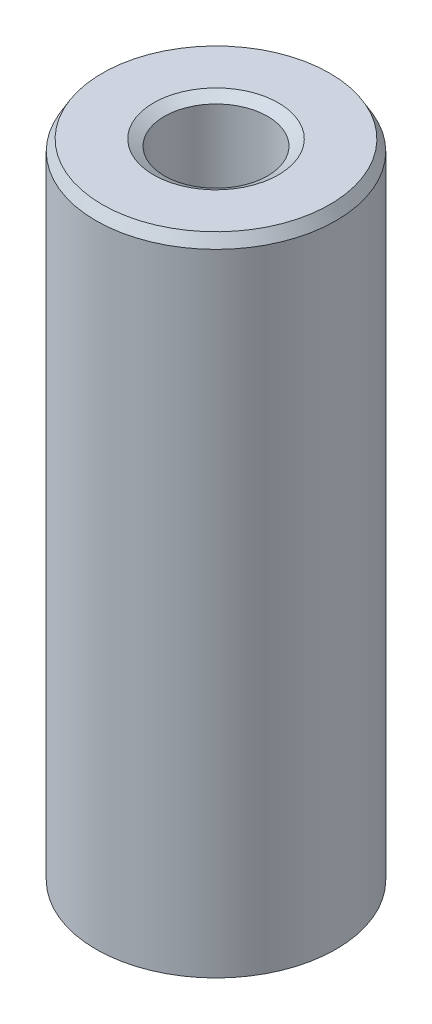
ISO-10303-21;
HEADER;
FILE_DESCRIPTION(('STEP AP214'),'2;1');
FILE_NAME('part.step','',(''),(''),'','','');
FILE_SCHEMA(('AUTOMOTIVE_DESIGN { 1 0 10303 214 1 1 1 1 }'));
ENDSEC;
DATA;
#1=APPLICATION_CONTEXT('core data for automotive mechanical design processes');
#2=APPLICATION_PROTOCOL_DEFINITION('international standard','automotive_design',2000,#1);
#3=PRODUCT_CONTEXT('',#1,'mechanical');
#4=PRODUCT('Part','Part','',(#3));
#5=PRODUCT_RELATED_PRODUCT_CATEGORY('part','',(#4));
#6=PRODUCT_DEFINITION_FORMATION('','',#4);
#7=PRODUCT_DEFINITION_CONTEXT('part definition',#1,'design');
#8=PRODUCT_DEFINITION('design','',#6,#7);
#9=PRODUCT_DEFINITION_SHAPE('','',#8);
#10=(LENGTH_UNIT() NAMED_UNIT(*) SI_UNIT(.MILLI.,.METRE.));
#11=(NAMED_UNIT(*) PLANE_ANGLE_UNIT() SI_UNIT($,.RADIAN.));
#12=(NAMED_UNIT(*) SI_UNIT($,.STERADIAN.) SOLID_ANGLE_UNIT());
#13=UNCERTAINTY_MEASURE_WITH_UNIT(LENGTH_MEASURE(1.E-05),#10,'distance_accuracy_value','');
#14=(GEOMETRIC_REPRESENTATION_CONTEXT(3) GLOBAL_UNCERTAINTY_ASSIGNED_CONTEXT((#13)) GLOBAL_UNIT_ASSIGNED_CONTEXT((#10,
#11,#12)) REPRESENTATION_CONTEXT('',''));
#15=CARTESIAN_POINT('',(0.,0.,0.));
#16=DIRECTION('',(0.,0.,1.));
#17=DIRECTION('',(1.,0.,0.));
#18=AXIS2_PLACEMENT_3D('',#15,#16,#17);
#19=CARTESIAN_POINT('',(0.,188.946257243484,0.));
#20=DIRECTION('',(0.,-1.,0.));
#21=DIRECTION('',(0.,0.,-1.));
#22=AXIS2_PLACEMENT_3D('',#19,#20,#21);
#23=CYLINDRICAL_SURFACE('',#22,35.);
#24=CARTESIAN_POINT('',(0.,1.82356444192366,0.));
#25=DIRECTION('',(0.,1.,0.));
#26=DIRECTION('',(0.,0.,1.));
#27=AXIS2_PLACEMENT_3D('',#24,#25,#26);
#28=CIRCLE('',#27,35.);
#29=CARTESIAN_POINT('',(0.,1.82356444192366,35.));
#30=VERTEX_POINT('',#29);
#31=EDGE_CURVE('E10',#30,#30,#28,.T.);
#32=ORIENTED_EDGE('',*,*,#31,.T.);
#33=EDGE_LOOP('',(#32));
#34=FACE_BOUND('',#33,.T.);
#35=CARTESIAN_POINT('',(0.,185.787750979196,0.));
#36=DIRECTION('',(0.,1.,0.));
#37=DIRECTION('',(0.,0.,1.));
#38=AXIS2_PLACEMENT_3D('',#35,#36,#37);
#39=CIRCLE('',#38,35.);
#40=CARTESIAN_POINT('',(0.,185.787750979196,35.));
#41=VERTEX_POINT('',#40);
#42=EDGE_CURVE('E50',#41,#41,#39,.F.);
#43=ORIENTED_EDGE('',*,*,#42,.T.);
#44=EDGE_LOOP('',(#43));
#45=FACE_BOUND('',#44,.T.);
#46=ADVANCED_FACE('F39',(#34,#45),#23,.T.);
#47=CARTESIAN_POINT('',(0.,188.946257243484,0.));
#48=DIRECTION('',(0.,1.,0.));
#49=DIRECTION('',(0.,0.,1.));
#50=AXIS2_PLACEMENT_3D('',#47,#48,#49);
#51=PLANE('',#50);
#52=CARTESIAN_POINT('',(0.,188.946257243484,0.));
#53=DIRECTION('',(0.,1.,0.));
#54=DIRECTION('',(0.,0.,1.));
#55=AXIS2_PLACEMENT_3D('',#52,#53,#54);
#56=CIRCLE('',#55,18.2065849074306);
#57=CARTESIAN_POINT('',(0.,188.946257243484,18.2065849074306));
#58=VERTEX_POINT('',#57);
#59=EDGE_CURVE('E58',#58,#58,#56,.F.);
#60=ORIENTED_EDGE('',*,*,#59,.T.);
#61=EDGE_LOOP('',(#60));
#62=FACE_BOUND('',#61,.T.);
#63=CARTESIAN_POINT('',(0.,188.946257243484,0.));
#64=DIRECTION('',(0.,1.,0.));
#65=DIRECTION('',(0.,0.,1.));
#66=AXIS2_PLACEMENT_3D('',#63,#64,#65);
#67=CIRCLE('',#66,33.1764355580764);
#68=CARTESIAN_POINT('',(0.,188.946257243484,33.1764355580764));
#69=VERTEX_POINT('',#68);
#70=EDGE_CURVE('E61',#69,#69,#67,.T.);
#71=ORIENTED_EDGE('',*,*,#70,.T.);
#72=EDGE_LOOP('',(#71));
#73=FACE_BOUND('',#72,.T.);
#74=ADVANCED_FACE('F88',(#62,#73),#51,.T.);
#75=CARTESIAN_POINT('',(0.,0.,0.));
#76=DIRECTION('',(0.,1.,0.));
#77=DIRECTION('',(0.,0.,1.));
#78=AXIS2_PLACEMENT_3D('',#75,#76,#77);
#79=PLANE('',#78);
#80=CARTESIAN_POINT('',(0.,0.,0.));
#81=DIRECTION('',(0.,1.,0.));
#82=DIRECTION('',(0.,0.,1.));
#83=AXIS2_PLACEMENT_3D('',#80,#81,#82);
#84=CIRCLE('',#83,16.8716430850665);
#85=CARTESIAN_POINT('',(0.,0.,-16.8716430850665));
#86=VERTEX_POINT('',#85);
#87=EDGE_CURVE('E51',#86,#86,#84,.T.);
#88=ORIENTED_EDGE('',*,*,#87,.T.);
#89=EDGE_LOOP('',(#88));
#90=FACE_BOUND('',#89,.T.);
#91=CARTESIAN_POINT('',(0.,0.,0.));
#92=DIRECTION('',(0.,1.,0.));
#93=DIRECTION('',(0.,0.,1.));
#94=AXIS2_PLACEMENT_3D('',#91,#92,#93);
#95=CIRCLE('',#94,31.8414937357122);
#96=CARTESIAN_POINT('',(0.,0.,31.8414937357122));
#97=VERTEX_POINT('',#96);
#98=EDGE_CURVE('E54',#97,#97,#95,.F.);
#99=ORIENTED_EDGE('',*,*,#98,.T.);
#100=EDGE_LOOP('',(#99));
#101=FACE_BOUND('',#100,.T.);
#102=ADVANCED_FACE('F83',(#90,#101),#79,.F.);
#103=CARTESIAN_POINT('',(0.,188.946257243484,0.));
#104=DIRECTION('',(0.,-1.,0.));
#105=DIRECTION('',(0.,0.,-1.));
#106=AXIS2_PLACEMENT_3D('',#103,#104,#105);
#107=CYLINDRICAL_SURFACE('',#106,15.0480786431428);
#108=CARTESIAN_POINT('',(0.,187.12269280156,0.));
#109=DIRECTION('',(0.,1.,0.));
#110=DIRECTION('',(0.,0.,1.));
#111=AXIS2_PLACEMENT_3D('',#108,#109,#110);
#112=CIRCLE('',#111,15.0480786431428);
#113=CARTESIAN_POINT('',(0.,187.12269280156,15.0480786431428));
#114=VERTEX_POINT('',#113);
#115=EDGE_CURVE('E67',#114,#114,#112,.T.);
#116=ORIENTED_EDGE('',*,*,#115,.T.);
#117=EDGE_LOOP('',(#116));
#118=FACE_BOUND('',#117,.T.);
#119=CARTESIAN_POINT('',(0.,3.15850626428779,0.));
#120=DIRECTION('',(0.,1.,0.));
#121=DIRECTION('',(0.,0.,1.));
#122=AXIS2_PLACEMENT_3D('',#119,#120,#121);
#123=CIRCLE('',#122,15.0480786431428);
#124=CARTESIAN_POINT('',(0.,3.15850626428779,-15.0480786431428));
#125=VERTEX_POINT('',#124);
#126=EDGE_CURVE('E69',#125,#125,#123,.F.);
#127=ORIENTED_EDGE('',*,*,#126,.T.);
#128=EDGE_LOOP('',(#127));
#129=FACE_BOUND('',#128,.T.);
#130=ADVANCED_FACE('F71',(#118,#129),#107,.F.);
#131=CARTESIAN_POINT('',(0.,187.12269280156,0.));
#132=DIRECTION('',(0.,1.,0.));
#133=DIRECTION('',(0.,0.,1.));
#134=AXIS2_PLACEMENT_3D('',#131,#132,#133);
#135=CONICAL_SURFACE('',#134,15.0480786431428,1.0471975511966);
#136=ORIENTED_EDGE('',*,*,#59,.F.);
#137=EDGE_LOOP('',(#136));
#138=FACE_BOUND('',#137,.T.);
#139=ORIENTED_EDGE('',*,*,#115,.F.);
#140=EDGE_LOOP('',(#139));
#141=FACE_BOUND('',#140,.T.);
#142=ADVANCED_FACE('F77',(#138,#141),#135,.F.);
#143=CARTESIAN_POINT('',(0.,0.,0.));
#144=DIRECTION('',(0.,-1.,0.));
#145=DIRECTION('',(0.,0.,-1.));
#146=AXIS2_PLACEMENT_3D('',#143,#144,#145);
#147=CONICAL_SURFACE('',#146,16.8716430850665,0.523598775598294);
#148=CARTESIAN_POINT('',(0.,3.15850626428779,-15.0480786431428));
#149=CARTESIAN_POINT('',(0.,3.12560515736813,-15.0670741060796));
#150=CARTESIAN_POINT('',(0.,3.09270405044846,-15.0860695690163));
#151=CARTESIAN_POINT('',(0.,3.02690183660913,-15.1240604948897));
#152=CARTESIAN_POINT('',(0.,2.99400072968947,-15.1430559578264));
#153=CARTESIAN_POINT('',(0.,2.92819851585014,-15.1810468836998));
#154=CARTESIAN_POINT('',(0.,2.89529740893047,-15.2000423466365));
#155=CARTESIAN_POINT('',(0.,2.82949519509115,-15.2380332725099));
#156=CARTESIAN_POINT('',(0.,2.79659408817148,-15.2570287354466));
#157=CARTESIAN_POINT('',(0.,2.73079187433215,-15.29501966132));
#158=CARTESIAN_POINT('',(0.,2.69789076741249,-15.3140151242567));
#159=CARTESIAN_POINT('',(0.,2.63208855357316,-15.3520060501301));
#160=CARTESIAN_POINT('',(0.,2.59918744665349,-15.3710015130668));
#161=CARTESIAN_POINT('',(0.,2.53338523281417,-15.4089924389402));
#162=CARTESIAN_POINT('',(0.,2.5004841258945,-15.4279879018769));
#163=CARTESIAN_POINT('',(0.,2.43468191205517,-15.4659788277504));
#164=CARTESIAN_POINT('',(0.,2.40178080513551,-15.4849742906871));
#165=CARTESIAN_POINT('',(0.,2.33597859129618,-15.5229652165605));
#166=CARTESIAN_POINT('',(0.,2.30307748437651,-15.5419606794972));
#167=CARTESIAN_POINT('',(0.,2.23727527053719,-15.5799516053706));
#168=CARTESIAN_POINT('',(0.,2.20437416361752,-15.5989470683073));
#169=CARTESIAN_POINT('',(0.,2.13857194977819,-15.6369379941807));
#170=CARTESIAN_POINT('',(0.,2.10567084285853,-15.6559334571174));
#171=CARTESIAN_POINT('',(0.,2.0398686290192,-15.6939243829908));
#172=CARTESIAN_POINT('',(0.,2.00696752209953,-15.7129198459275));
#173=CARTESIAN_POINT('',(0.,1.9411653082602,-15.7509107718009));
#174=CARTESIAN_POINT('',(0.,1.90826420134054,-15.7699062347376));
#175=CARTESIAN_POINT('',(0.,1.84246198750121,-15.807897160611));
#176=CARTESIAN_POINT('',(0.,1.80956088058155,-15.8268926235477));
#177=CARTESIAN_POINT('',(0.,1.74375866674222,-15.8648835494212));
#178=CARTESIAN_POINT('',(0.,1.71085755982255,-15.8838790123579));
#179=CARTESIAN_POINT('',(0.,1.64505534598322,-15.9218699382313));
#180=CARTESIAN_POINT('',(0.,1.61215423906356,-15.940865401168));
#181=CARTESIAN_POINT('',(0.,1.54635202522423,-15.9788563270414));
#182=CARTESIAN_POINT('',(0.,1.51345091830457,-15.9978517899781));
#183=CARTESIAN_POINT('',(0.,1.44764870446524,-16.0358427158515));
#184=CARTESIAN_POINT('',(0.,1.41474759754557,-16.0548381787882));
#185=CARTESIAN_POINT('',(0.,1.34894538370624,-16.0928291046616));
#186=CARTESIAN_POINT('',(0.,1.31604427678658,-16.1118245675983));
#187=CARTESIAN_POINT('',(0.,1.25024206294725,-16.1498154934717));
#188=CARTESIAN_POINT('',(0.,1.21734095602759,-16.1688109564084));
#189=CARTESIAN_POINT('',(0.,1.15153874218826,-16.2068018822818));
#190=CARTESIAN_POINT('',(0.,1.11863763526859,-16.2257973452185));
#191=CARTESIAN_POINT('',(0.,1.05283542142926,-16.2637882710919));
#192=CARTESIAN_POINT('',(0.,1.0199343145096,-16.2827837340287));
#193=CARTESIAN_POINT('',(0.,0.95413210067027,-16.3207746599021));
#194=CARTESIAN_POINT('',(0.,0.921230993750606,-16.3397701228388));
#195=CARTESIAN_POINT('',(0.,0.855428779911277,-16.3777610487122));
#196=CARTESIAN_POINT('',(0.,0.822527672991612,-16.3967565116489));
#197=CARTESIAN_POINT('',(0.,0.756725459152283,-16.4347474375223));
#198=CARTESIAN_POINT('',(0.,0.723824352232619,-16.453742900459));
#199=CARTESIAN_POINT('',(0.,0.65802213839329,-16.4917338263324));
#200=CARTESIAN_POINT('',(0.,0.625121031473626,-16.5107292892691));
#201=CARTESIAN_POINT('',(0.,0.559318817634296,-16.5487202151425));
#202=CARTESIAN_POINT('',(0.,0.526417710714632,-16.5677156780792));
#203=CARTESIAN_POINT('',(0.,0.460615496875303,-16.6057066039526));
#204=CARTESIAN_POINT('',(0.,0.427714389955638,-16.6247020668893));
#205=CARTESIAN_POINT('',(0.,0.361912176116309,-16.6626929927627));
#206=CARTESIAN_POINT('',(0.,0.329011069196645,-16.6816884556995));
#207=CARTESIAN_POINT('',(0.,0.263208855357316,-16.7196793815729));
#208=CARTESIAN_POINT('',(0.,0.230307748437651,-16.7386748445096));
#209=CARTESIAN_POINT('',(0.,0.164505534598322,-16.776665770383));
#210=CARTESIAN_POINT('',(0.,0.131604427678658,-16.7956612333197));
#211=CARTESIAN_POINT('',(0.,0.065802213839329,-16.8336521591931));
#212=CARTESIAN_POINT('',(0.,0.0329011069196645,-16.8526476221298));
#213=CARTESIAN_POINT('',(0.,0.,-16.8716430850665));
#214=B_SPLINE_CURVE_WITH_KNOTS('',3,(#148,#149,#150,#151,#152,#153,#154,#155,#156,#157,#158,
#159,#160,#161,#162,#163,#164,#165,#166,#167,#168,#169,#170,#171,#172,#173,#174,#175,#176,#177,
#178,#179,#180,#181,#182,#183,#184,#185,#186,#187,#188,#189,#190,#191,#192,#193,#194,#195,#196,
#197,#198,#199,#200,#201,#202,#203,#204,#205,#206,#207,#208,#209,#210,#211,#212,#213),
.UNSPECIFIED.,.F.,.F.,(4,2,2,2,2,2,2,2,2,2,2,2,2,2,2,2,2,2,2,2,2,2,2,2,2,2,2,2,2,2,2,2,4),(0.,
0.11397277762023,0.227945555240459,0.341918332860688,0.455891110480917,0.569863888101147,
0.683836665721376,0.797809443341606,0.911782220961835,1.02575499858206,1.13972777620229,
1.25370055382252,1.36767333144275,1.48164610906298,1.59561888668321,1.70959166430344,
1.82356444192367,1.9375372195439,2.05150999716413,2.16548277478436,2.27945555240459,
2.39342833002482,2.50740110764505,2.62137388526527,2.7353466628855,2.84931944050573,
2.96329221812596,3.07726499574619,3.19123777336642,3.30521055098665,3.41918332860688,
3.53315610622711,3.64712888384734),.UNSPECIFIED.);
#215=EDGE_CURVE('BSEAM73',#125,#86,#214,.T.);
#216=ORIENTED_EDGE('',*,*,#126,.F.);
#217=ORIENTED_EDGE('',*,*,#87,.F.);
#218=ORIENTED_EDGE('',*,*,#215,.T.);
#219=ORIENTED_EDGE('',*,*,#215,.F.);
#220=EDGE_LOOP('',(#216,#218,#217,#219));
#221=FACE_BOUND('',#220,.T.);
#222=ADVANCED_FACE('F73',(#221),#147,.F.);
#223=CARTESIAN_POINT('',(0.,1.82356444192366,0.));
#224=DIRECTION('',(0.,1.,0.));
#225=DIRECTION('',(0.,0.,1.));
#226=AXIS2_PLACEMENT_3D('',#223,#224,#225);
#227=CONICAL_SURFACE('',#226,35.,1.0471975511966);
#228=ORIENTED_EDGE('',*,*,#98,.F.);
#229=EDGE_LOOP('',(#228));
#230=FACE_BOUND('',#229,.T.);
#231=ORIENTED_EDGE('',*,*,#31,.F.);
#232=EDGE_LOOP('',(#231));
#233=FACE_BOUND('',#232,.T.);
#234=ADVANCED_FACE('F76',(#230,#233),#227,.T.);
#235=CARTESIAN_POINT('',(0.,188.946257243484,0.));
#236=DIRECTION('',(0.,-1.,0.));
#237=DIRECTION('',(0.,0.,-1.));
#238=AXIS2_PLACEMENT_3D('',#235,#236,#237);
#239=CONICAL_SURFACE('',#238,33.1764355580764,0.523598775598292);
#240=ORIENTED_EDGE('',*,*,#42,.F.);
#241=EDGE_LOOP('',(#240));
#242=FACE_BOUND('',#241,.T.);
#243=ORIENTED_EDGE('',*,*,#70,.F.);
#244=EDGE_LOOP('',(#243));
#245=FACE_BOUND('',#244,.T.);
#246=ADVANCED_FACE('F45',(#242,#245),#239,.T.);
#247=CLOSED_SHELL('',(#46,#74,#102,#130,#142,#222,#234,#246));
#248=MANIFOLD_SOLID_BREP('B2',#247);
#249=ADVANCED_BREP_SHAPE_REPRESENTATION('',(#18,#248),#14);
#250=SHAPE_DEFINITION_REPRESENTATION(#9,#249);
ENDSEC;
END-ISO-10303-21;
